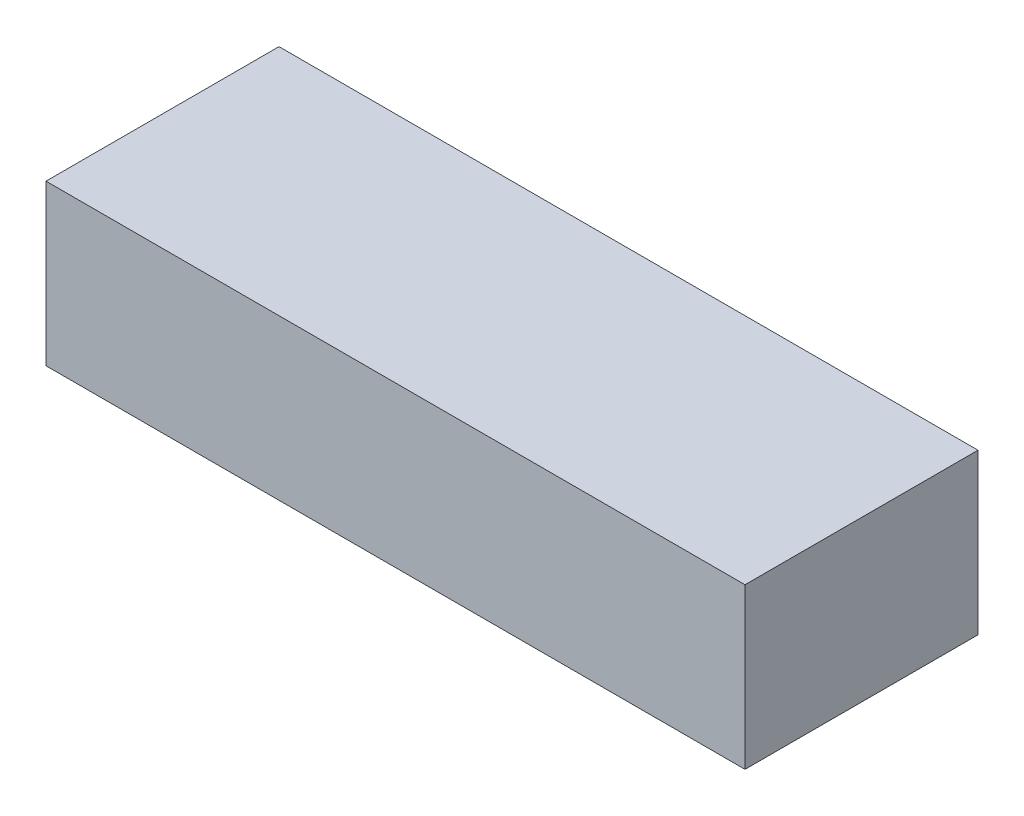
ISO-10303-21;
HEADER;
FILE_DESCRIPTION(('STEP AP214'),'2;1');
FILE_NAME('part.step','',(''),(''),'','','');
FILE_SCHEMA(('AUTOMOTIVE_DESIGN { 1 0 10303 214 1 1 1 1 }'));
ENDSEC;
DATA;
#1=APPLICATION_CONTEXT('core data for automotive mechanical design processes');
#2=APPLICATION_PROTOCOL_DEFINITION('international standard','automotive_design',2000,#1);
#3=PRODUCT_CONTEXT('',#1,'mechanical');
#4=PRODUCT('Part','Part','',(#3));
#5=PRODUCT_RELATED_PRODUCT_CATEGORY('part','',(#4));
#6=PRODUCT_DEFINITION_FORMATION('','',#4);
#7=PRODUCT_DEFINITION_CONTEXT('part definition',#1,'design');
#8=PRODUCT_DEFINITION('design','',#6,#7);
#9=PRODUCT_DEFINITION_SHAPE('','',#8);
#10=(LENGTH_UNIT() NAMED_UNIT(*) SI_UNIT(.MILLI.,.METRE.));
#11=(NAMED_UNIT(*) PLANE_ANGLE_UNIT() SI_UNIT($,.RADIAN.));
#12=(NAMED_UNIT(*) SI_UNIT($,.STERADIAN.) SOLID_ANGLE_UNIT());
#13=UNCERTAINTY_MEASURE_WITH_UNIT(LENGTH_MEASURE(1.E-05),#10,'distance_accuracy_value','');
#14=(GEOMETRIC_REPRESENTATION_CONTEXT(3) GLOBAL_UNCERTAINTY_ASSIGNED_CONTEXT((#13)) GLOBAL_UNIT_ASSIGNED_CONTEXT((#10,
#11,#12)) REPRESENTATION_CONTEXT('',''));
#15=CARTESIAN_POINT('',(0.,0.,0.));
#16=DIRECTION('',(0.,0.,1.));
#17=DIRECTION('',(1.,0.,0.));
#18=AXIS2_PLACEMENT_3D('',#15,#16,#17);
#19=CARTESIAN_POINT('',(153.,70.,-51.));
#20=DIRECTION('',(-1.,0.,0.));
#21=DIRECTION('',(0.,0.,1.));
#22=AXIS2_PLACEMENT_3D('',#19,#20,#21);
#23=PLANE('',#22);
#24=DIRECTION('',(0.,0.,-1.));
#25=VECTOR('',#24,1.);
#26=CARTESIAN_POINT('',(153.,0.,-51.));
#27=LINE('',#26,#25);
#28=CARTESIAN_POINT('',(153.,0.,51.));
#29=VERTEX_POINT('',#28);
#30=CARTESIAN_POINT('',(153.,0.,-51.));
#31=VERTEX_POINT('',#30);
#32=EDGE_CURVE('E107',#29,#31,#27,.T.);
#33=ORIENTED_EDGE('',*,*,#32,.T.);
#34=DIRECTION('',(0.,-1.,0.));
#35=VECTOR('',#34,1.);
#36=CARTESIAN_POINT('',(153.,70.,-51.));
#37=LINE('',#36,#35);
#38=CARTESIAN_POINT('',(153.,70.,-51.));
#39=VERTEX_POINT('',#38);
#40=EDGE_CURVE('E11',#39,#31,#37,.T.);
#41=ORIENTED_EDGE('',*,*,#40,.F.);
#42=DIRECTION('',(0.,0.,-1.));
#43=VECTOR('',#42,1.);
#44=CARTESIAN_POINT('',(153.,70.,-51.));
#45=LINE('',#44,#43);
#46=CARTESIAN_POINT('',(153.,70.,51.));
#47=VERTEX_POINT('',#46);
#48=EDGE_CURVE('E91',#47,#39,#45,.T.);
#49=ORIENTED_EDGE('',*,*,#48,.F.);
#50=DIRECTION('',(0.,-1.,0.));
#51=VECTOR('',#50,1.);
#52=CARTESIAN_POINT('',(153.,70.,51.));
#53=LINE('',#52,#51);
#54=EDGE_CURVE('E103',#47,#29,#53,.T.);
#55=ORIENTED_EDGE('',*,*,#54,.T.);
#56=EDGE_LOOP('',(#33,#41,#49,#55));
#57=FACE_BOUND('',#56,.T.);
#58=ADVANCED_FACE('F39',(#57),#23,.F.);
#59=CARTESIAN_POINT('',(-153.,70.,-51.));
#60=DIRECTION('',(0.,0.,1.));
#61=DIRECTION('',(1.,0.,0.));
#62=AXIS2_PLACEMENT_3D('',#59,#60,#61);
#63=PLANE('',#62);
#64=DIRECTION('',(-1.,0.,0.));
#65=VECTOR('',#64,1.);
#66=CARTESIAN_POINT('',(-153.,0.,-51.));
#67=LINE('',#66,#65);
#68=CARTESIAN_POINT('',(-153.,0.,-51.));
#69=VERTEX_POINT('',#68);
#70=EDGE_CURVE('E96',#31,#69,#67,.T.);
#71=ORIENTED_EDGE('',*,*,#70,.T.);
#72=DIRECTION('',(0.,-1.,0.));
#73=VECTOR('',#72,1.);
#74=CARTESIAN_POINT('',(-153.,70.,-51.));
#75=LINE('',#74,#73);
#76=CARTESIAN_POINT('',(-153.,70.,-51.));
#77=VERTEX_POINT('',#76);
#78=EDGE_CURVE('E48',#77,#69,#75,.T.);
#79=ORIENTED_EDGE('',*,*,#78,.F.);
#80=DIRECTION('',(-1.,0.,0.));
#81=VECTOR('',#80,1.);
#82=CARTESIAN_POINT('',(-153.,70.,-51.));
#83=LINE('',#82,#81);
#84=EDGE_CURVE('E86',#39,#77,#83,.T.);
#85=ORIENTED_EDGE('',*,*,#84,.F.);
#86=ORIENTED_EDGE('',*,*,#40,.T.);
#87=EDGE_LOOP('',(#71,#79,#85,#86));
#88=FACE_BOUND('',#87,.T.);
#89=ADVANCED_FACE('F95',(#88),#63,.F.);
#90=CARTESIAN_POINT('',(-153.,70.,-51.));
#91=DIRECTION('',(1.,0.,0.));
#92=DIRECTION('',(0.,0.,-1.));
#93=AXIS2_PLACEMENT_3D('',#90,#91,#92);
#94=PLANE('',#93);
#95=DIRECTION('',(0.,0.,1.));
#96=VECTOR('',#95,1.);
#97=CARTESIAN_POINT('',(-153.,0.,-51.));
#98=LINE('',#97,#96);
#99=CARTESIAN_POINT('',(-153.,0.,51.));
#100=VERTEX_POINT('',#99);
#101=EDGE_CURVE('E73',#69,#100,#98,.T.);
#102=ORIENTED_EDGE('',*,*,#101,.T.);
#103=DIRECTION('',(0.,-1.,0.));
#104=VECTOR('',#103,1.);
#105=CARTESIAN_POINT('',(-153.,70.,51.));
#106=LINE('',#105,#104);
#107=CARTESIAN_POINT('',(-153.,70.,51.));
#108=VERTEX_POINT('',#107);
#109=EDGE_CURVE('E98',#108,#100,#106,.T.);
#110=ORIENTED_EDGE('',*,*,#109,.F.);
#111=DIRECTION('',(0.,0.,1.));
#112=VECTOR('',#111,1.);
#113=CARTESIAN_POINT('',(-153.,70.,-51.));
#114=LINE('',#113,#112);
#115=EDGE_CURVE('E89',#77,#108,#114,.T.);
#116=ORIENTED_EDGE('',*,*,#115,.F.);
#117=ORIENTED_EDGE('',*,*,#78,.T.);
#118=EDGE_LOOP('',(#102,#110,#116,#117));
#119=FACE_BOUND('',#118,.T.);
#120=ADVANCED_FACE('F99',(#119),#94,.F.);
#121=CARTESIAN_POINT('',(-153.,70.,51.));
#122=DIRECTION('',(0.,0.,-1.));
#123=DIRECTION('',(-1.,0.,0.));
#124=AXIS2_PLACEMENT_3D('',#121,#122,#123);
#125=PLANE('',#124);
#126=DIRECTION('',(1.,0.,0.));
#127=VECTOR('',#126,1.);
#128=CARTESIAN_POINT('',(-153.,0.,51.));
#129=LINE('',#128,#127);
#130=EDGE_CURVE('E79',#100,#29,#129,.T.);
#131=ORIENTED_EDGE('',*,*,#130,.T.);
#132=ORIENTED_EDGE('',*,*,#54,.F.);
#133=DIRECTION('',(1.,0.,0.));
#134=VECTOR('',#133,1.);
#135=CARTESIAN_POINT('',(-153.,70.,51.));
#136=LINE('',#135,#134);
#137=EDGE_CURVE('E56',#108,#47,#136,.T.);
#138=ORIENTED_EDGE('',*,*,#137,.F.);
#139=ORIENTED_EDGE('',*,*,#109,.T.);
#140=EDGE_LOOP('',(#131,#132,#138,#139));
#141=FACE_BOUND('',#140,.T.);
#142=ADVANCED_FACE('F120',(#141),#125,.F.);
#143=CARTESIAN_POINT('',(0.,70.,0.));
#144=DIRECTION('',(0.,1.,0.));
#145=DIRECTION('',(0.,0.,1.));
#146=AXIS2_PLACEMENT_3D('',#143,#144,#145);
#147=PLANE('',#146);
#148=ORIENTED_EDGE('',*,*,#48,.T.);
#149=ORIENTED_EDGE('',*,*,#84,.T.);
#150=ORIENTED_EDGE('',*,*,#115,.T.);
#151=ORIENTED_EDGE('',*,*,#137,.T.);
#152=EDGE_LOOP('',(#148,#149,#150,#151));
#153=FACE_BOUND('',#152,.T.);
#154=ADVANCED_FACE('F87',(#153),#147,.T.);
#155=CARTESIAN_POINT('',(0.,0.,0.));
#156=DIRECTION('',(0.,1.,0.));
#157=DIRECTION('',(0.,0.,1.));
#158=AXIS2_PLACEMENT_3D('',#155,#156,#157);
#159=PLANE('',#158);
#160=ORIENTED_EDGE('',*,*,#32,.F.);
#161=ORIENTED_EDGE('',*,*,#130,.F.);
#162=ORIENTED_EDGE('',*,*,#101,.F.);
#163=ORIENTED_EDGE('',*,*,#70,.F.);
#164=EDGE_LOOP('',(#160,#161,#162,#163));
#165=FACE_BOUND('',#164,.T.);
#166=ADVANCED_FACE('F123',(#165),#159,.F.);
#167=CLOSED_SHELL('',(#58,#89,#120,#142,#154,#166));
#168=MANIFOLD_SOLID_BREP('B2',#167);
#169=ADVANCED_BREP_SHAPE_REPRESENTATION('',(#18,#168),#14);
#170=SHAPE_DEFINITION_REPRESENTATION(#9,#169);
ENDSEC;
END-ISO-10303-21;
